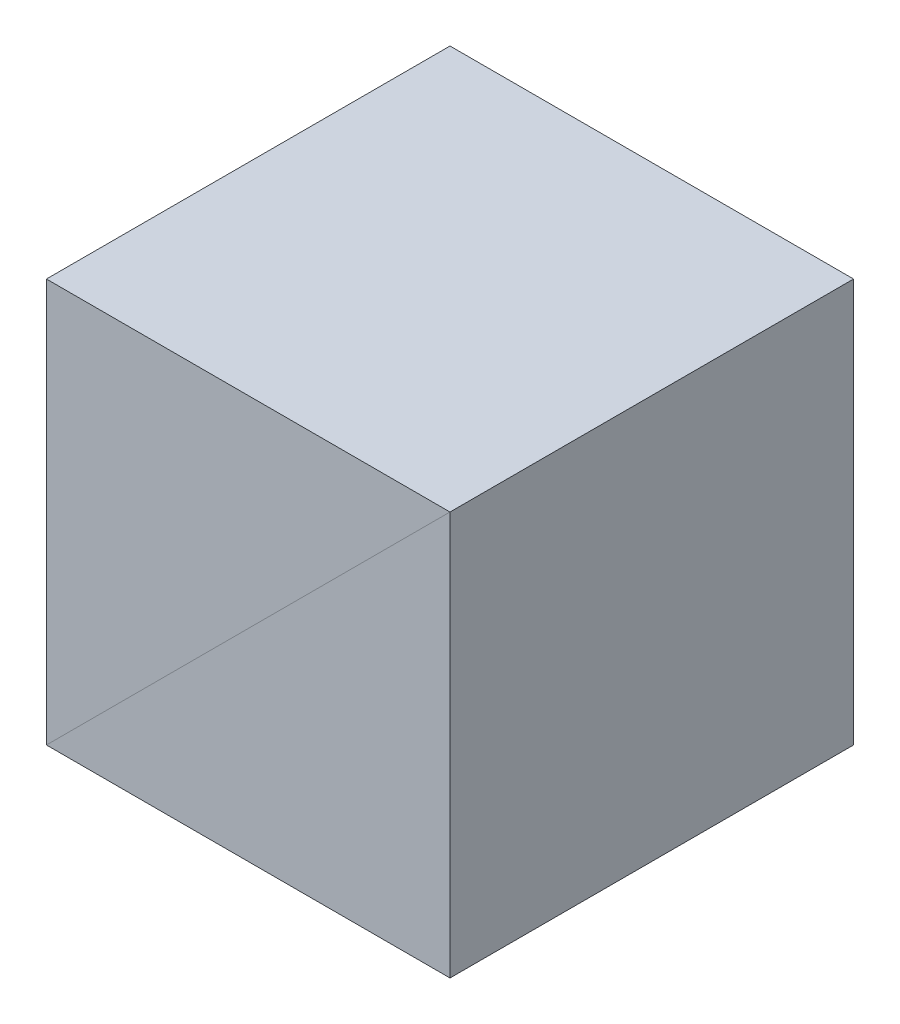
ISO-10303-21;
HEADER;
FILE_DESCRIPTION(('STEP AP214'),'2;1');
FILE_NAME('part.step','',(''),(''),'','','');
FILE_SCHEMA(('AUTOMOTIVE_DESIGN { 1 0 10303 214 1 1 1 1 }'));
ENDSEC;
DATA;
#1=APPLICATION_CONTEXT('core data for automotive mechanical design processes');
#2=APPLICATION_PROTOCOL_DEFINITION('international standard','automotive_design',2000,#1);
#3=PRODUCT_CONTEXT('',#1,'mechanical');
#4=PRODUCT('Part','Part','',(#3));
#5=PRODUCT_RELATED_PRODUCT_CATEGORY('part','',(#4));
#6=PRODUCT_DEFINITION_FORMATION('','',#4);
#7=PRODUCT_DEFINITION_CONTEXT('part definition',#1,'design');
#8=PRODUCT_DEFINITION('design','',#6,#7);
#9=PRODUCT_DEFINITION_SHAPE('','',#8);
#10=(LENGTH_UNIT() NAMED_UNIT(*) SI_UNIT(.MILLI.,.METRE.));
#11=(NAMED_UNIT(*) PLANE_ANGLE_UNIT() SI_UNIT($,.RADIAN.));
#12=(NAMED_UNIT(*) SI_UNIT($,.STERADIAN.) SOLID_ANGLE_UNIT());
#13=UNCERTAINTY_MEASURE_WITH_UNIT(LENGTH_MEASURE(1.E-05),#10,'distance_accuracy_value','');
#14=(GEOMETRIC_REPRESENTATION_CONTEXT(3) GLOBAL_UNCERTAINTY_ASSIGNED_CONTEXT((#13)) GLOBAL_UNIT_ASSIGNED_CONTEXT((#10,
#11,#12)) REPRESENTATION_CONTEXT('',''));
#15=CARTESIAN_POINT('',(0.,0.,0.));
#16=DIRECTION('',(0.,0.,1.));
#17=DIRECTION('',(1.,0.,0.));
#18=AXIS2_PLACEMENT_3D('',#15,#16,#17);
#19=CARTESIAN_POINT('',(5.,5.,5.));
#20=DIRECTION('',(-0.707106781186547,0.707106781186548,0.));
#21=DIRECTION('',(0.707106781186548,0.707106781186547,0.));
#22=AXIS2_PLACEMENT_3D('',#19,#20,#21);
#23=PLANE('',#22);
#24=DIRECTION('',(-0.707106781186548,-0.707106781186547,0.));
#25=VECTOR('',#24,1.);
#26=CARTESIAN_POINT('',(5.,5.,-5.));
#27=LINE('',#26,#25);
#28=CARTESIAN_POINT('',(5.,5.,-5.));
#29=VERTEX_POINT('',#28);
#30=CARTESIAN_POINT('',(-5.,-5.,-5.));
#31=VERTEX_POINT('',#30);
#32=EDGE_CURVE('E101',#29,#31,#27,.T.);
#33=ORIENTED_EDGE('',*,*,#32,.F.);
#34=DIRECTION('',(0.,0.,-1.));
#35=VECTOR('',#34,1.);
#36=CARTESIAN_POINT('',(5.,5.,5.));
#37=LINE('',#36,#35);
#38=CARTESIAN_POINT('',(5.,5.,5.));
#39=VERTEX_POINT('',#38);
#40=EDGE_CURVE('E96',#39,#29,#37,.T.);
#41=ORIENTED_EDGE('',*,*,#40,.F.);
#42=DIRECTION('',(-0.707106781186548,-0.707106781186547,0.));
#43=VECTOR('',#42,1.);
#44=CARTESIAN_POINT('',(5.,5.,5.));
#45=LINE('',#44,#43);
#46=CARTESIAN_POINT('',(-5.,-5.,5.));
#47=VERTEX_POINT('',#46);
#48=EDGE_CURVE('E88',#39,#47,#45,.T.);
#49=ORIENTED_EDGE('',*,*,#48,.T.);
#50=DIRECTION('',(0.,0.,-1.));
#51=VECTOR('',#50,1.);
#52=CARTESIAN_POINT('',(-5.,-5.,5.));
#53=LINE('',#52,#51);
#54=EDGE_CURVE('E12',#47,#31,#53,.T.);
#55=ORIENTED_EDGE('',*,*,#54,.T.);
#56=EDGE_LOOP('',(#33,#41,#49,#55));
#57=FACE_BOUND('',#56,.T.);
#58=ADVANCED_FACE('F49',(#57),#23,.F.);
#59=CARTESIAN_POINT('',(-5.,-5.,5.));
#60=DIRECTION('',(1.,0.,0.));
#61=DIRECTION('',(0.,0.,1.));
#62=AXIS2_PLACEMENT_3D('',#59,#60,#61);
#63=PLANE('',#62);
#64=DIRECTION('',(0.,1.,0.));
#65=VECTOR('',#64,1.);
#66=CARTESIAN_POINT('',(-5.,-5.,-5.));
#67=LINE('',#66,#65);
#68=CARTESIAN_POINT('',(-5.,5.,-5.));
#69=VERTEX_POINT('',#68);
#70=EDGE_CURVE('E93',#31,#69,#67,.T.);
#71=ORIENTED_EDGE('',*,*,#70,.F.);
#72=ORIENTED_EDGE('',*,*,#54,.F.);
#73=DIRECTION('',(0.,1.,0.));
#74=VECTOR('',#73,1.);
#75=CARTESIAN_POINT('',(-5.,-5.,5.));
#76=LINE('',#75,#74);
#77=CARTESIAN_POINT('',(-5.,5.,5.));
#78=VERTEX_POINT('',#77);
#79=EDGE_CURVE('E84',#47,#78,#76,.T.);
#80=ORIENTED_EDGE('',*,*,#79,.T.);
#81=DIRECTION('',(0.,0.,-1.));
#82=VECTOR('',#81,1.);
#83=CARTESIAN_POINT('',(-5.,5.,5.));
#84=LINE('',#83,#82);
#85=EDGE_CURVE('E57',#78,#69,#84,.T.);
#86=ORIENTED_EDGE('',*,*,#85,.T.);
#87=EDGE_LOOP('',(#71,#72,#80,#86));
#88=FACE_BOUND('',#87,.T.);
#89=ADVANCED_FACE('F92',(#88),#63,.F.);
#90=CARTESIAN_POINT('',(5.,5.,5.));
#91=DIRECTION('',(0.,-1.,0.));
#92=DIRECTION('',(-1.,0.,0.));
#93=AXIS2_PLACEMENT_3D('',#90,#91,#92);
#94=PLANE('',#93);
#95=DIRECTION('',(1.,0.,0.));
#96=VECTOR('',#95,1.);
#97=CARTESIAN_POINT('',(5.,5.,-5.));
#98=LINE('',#97,#96);
#99=EDGE_CURVE('E76',#69,#29,#98,.T.);
#100=ORIENTED_EDGE('',*,*,#99,.F.);
#101=ORIENTED_EDGE('',*,*,#85,.F.);
#102=DIRECTION('',(1.,0.,0.));
#103=VECTOR('',#102,1.);
#104=CARTESIAN_POINT('',(5.,5.,5.));
#105=LINE('',#104,#103);
#106=EDGE_CURVE('E65',#78,#39,#105,.T.);
#107=ORIENTED_EDGE('',*,*,#106,.T.);
#108=ORIENTED_EDGE('',*,*,#40,.T.);
#109=EDGE_LOOP('',(#100,#101,#107,#108));
#110=FACE_BOUND('',#109,.T.);
#111=ADVANCED_FACE('F110',(#110),#94,.F.);
#112=CARTESIAN_POINT('',(0.,0.,5.));
#113=DIRECTION('',(0.,0.,1.));
#114=DIRECTION('',(0.,1.,0.));
#115=AXIS2_PLACEMENT_3D('',#112,#113,#114);
#116=PLANE('',#115);
#117=ORIENTED_EDGE('',*,*,#48,.F.);
#118=ORIENTED_EDGE('',*,*,#106,.F.);
#119=ORIENTED_EDGE('',*,*,#79,.F.);
#120=EDGE_LOOP('',(#117,#118,#119));
#121=FACE_BOUND('',#120,.T.);
#122=ADVANCED_FACE('F86',(#121),#116,.T.);
#123=CARTESIAN_POINT('',(0.,0.,-5.));
#124=DIRECTION('',(0.,0.,1.));
#125=DIRECTION('',(0.,1.,0.));
#126=AXIS2_PLACEMENT_3D('',#123,#124,#125);
#127=PLANE('',#126);
#128=ORIENTED_EDGE('',*,*,#32,.T.);
#129=ORIENTED_EDGE('',*,*,#70,.T.);
#130=ORIENTED_EDGE('',*,*,#99,.T.);
#131=EDGE_LOOP('',(#128,#129,#130));
#132=FACE_BOUND('',#131,.T.);
#133=ADVANCED_FACE('F104',(#132),#127,.F.);
#134=CLOSED_SHELL('',(#58,#89,#111,#122,#133));
#135=MANIFOLD_SOLID_BREP('B2',#134);
#136=CARTESIAN_POINT('',(5.,5.,5.));
#137=DIRECTION('',(0.707106781186547,-0.707106781186548,0.));
#138=DIRECTION('',(0.707106781186548,0.707106781186547,0.));
#139=AXIS2_PLACEMENT_3D('',#136,#137,#138);
#140=PLANE('',#139);
#141=DIRECTION('',(-0.707106781186548,-0.707106781186547,0.));
#142=VECTOR('',#141,1.);
#143=CARTESIAN_POINT('',(5.,5.,-5.));
#144=LINE('',#143,#142);
#145=CARTESIAN_POINT('',(5.,5.,-5.));
#146=VERTEX_POINT('',#145);
#147=CARTESIAN_POINT('',(-5.,-5.,-5.));
#148=VERTEX_POINT('',#147);
#149=EDGE_CURVE('E197',#146,#148,#144,.T.);
#150=ORIENTED_EDGE('',*,*,#149,.T.);
#151=DIRECTION('',(0.,0.,-1.));
#152=VECTOR('',#151,1.);
#153=CARTESIAN_POINT('',(-5.,-5.,5.));
#154=LINE('',#153,#152);
#155=CARTESIAN_POINT('',(-5.,-5.,5.));
#156=VERTEX_POINT('',#155);
#157=EDGE_CURVE('E47',#156,#148,#154,.T.);
#158=ORIENTED_EDGE('',*,*,#157,.F.);
#159=DIRECTION('',(-0.707106781186548,-0.707106781186547,0.));
#160=VECTOR('',#159,1.);
#161=CARTESIAN_POINT('',(5.,5.,5.));
#162=LINE('',#161,#160);
#163=CARTESIAN_POINT('',(5.,5.,5.));
#164=VERTEX_POINT('',#163);
#165=EDGE_CURVE('E189',#164,#156,#162,.T.);
#166=ORIENTED_EDGE('',*,*,#165,.F.);
#167=DIRECTION('',(0.,0.,-1.));
#168=VECTOR('',#167,1.);
#169=CARTESIAN_POINT('',(5.,5.,5.));
#170=LINE('',#169,#168);
#171=EDGE_CURVE('E198',#164,#146,#170,.T.);
#172=ORIENTED_EDGE('',*,*,#171,.T.);
#173=EDGE_LOOP('',(#150,#158,#166,#172));
#174=FACE_BOUND('',#173,.T.);
#175=ADVANCED_FACE('F147',(#174),#140,.F.);
#176=CARTESIAN_POINT('',(-5.,-5.,5.));
#177=DIRECTION('',(0.,1.,0.));
#178=DIRECTION('',(0.,0.,1.));
#179=AXIS2_PLACEMENT_3D('',#176,#177,#178);
#180=PLANE('',#179);
#181=DIRECTION('',(1.,0.,0.));
#182=VECTOR('',#181,1.);
#183=CARTESIAN_POINT('',(-5.,-5.,-5.));
#184=LINE('',#183,#182);
#185=CARTESIAN_POINT('',(5.,-5.,-5.));
#186=VERTEX_POINT('',#185);
#187=EDGE_CURVE('E176',#148,#186,#184,.T.);
#188=ORIENTED_EDGE('',*,*,#187,.T.);
#189=DIRECTION('',(0.,0.,-1.));
#190=VECTOR('',#189,1.);
#191=CARTESIAN_POINT('',(5.,-5.,5.));
#192=LINE('',#191,#190);
#193=CARTESIAN_POINT('',(5.,-5.,5.));
#194=VERTEX_POINT('',#193);
#195=EDGE_CURVE('E156',#194,#186,#192,.T.);
#196=ORIENTED_EDGE('',*,*,#195,.F.);
#197=DIRECTION('',(1.,0.,0.));
#198=VECTOR('',#197,1.);
#199=CARTESIAN_POINT('',(-5.,-5.,5.));
#200=LINE('',#199,#198);
#201=EDGE_CURVE('E184',#156,#194,#200,.T.);
#202=ORIENTED_EDGE('',*,*,#201,.F.);
#203=ORIENTED_EDGE('',*,*,#157,.T.);
#204=EDGE_LOOP('',(#188,#196,#202,#203));
#205=FACE_BOUND('',#204,.T.);
#206=ADVANCED_FACE('F185',(#205),#180,.F.);
#207=CARTESIAN_POINT('',(5.,5.,5.));
#208=DIRECTION('',(-1.,0.,0.));
#209=DIRECTION('',(0.,-1.,0.));
#210=AXIS2_PLACEMENT_3D('',#207,#208,#209);
#211=PLANE('',#210);
#212=DIRECTION('',(0.,1.,0.));
#213=VECTOR('',#212,1.);
#214=CARTESIAN_POINT('',(5.,5.,-5.));
#215=LINE('',#214,#213);
#216=EDGE_CURVE('E181',#186,#146,#215,.T.);
#217=ORIENTED_EDGE('',*,*,#216,.T.);
#218=ORIENTED_EDGE('',*,*,#171,.F.);
#219=DIRECTION('',(0.,1.,0.));
#220=VECTOR('',#219,1.);
#221=CARTESIAN_POINT('',(5.,5.,5.));
#222=LINE('',#221,#220);
#223=EDGE_CURVE('E164',#194,#164,#222,.T.);
#224=ORIENTED_EDGE('',*,*,#223,.F.);
#225=ORIENTED_EDGE('',*,*,#195,.T.);
#226=EDGE_LOOP('',(#217,#218,#224,#225));
#227=FACE_BOUND('',#226,.T.);
#228=ADVANCED_FACE('F210',(#227),#211,.F.);
#229=CARTESIAN_POINT('',(0.,0.,5.));
#230=DIRECTION('',(0.,0.,1.));
#231=DIRECTION('',(1.,0.,0.));
#232=AXIS2_PLACEMENT_3D('',#229,#230,#231);
#233=PLANE('',#232);
#234=ORIENTED_EDGE('',*,*,#165,.T.);
#235=ORIENTED_EDGE('',*,*,#201,.T.);
#236=ORIENTED_EDGE('',*,*,#223,.T.);
#237=EDGE_LOOP('',(#234,#235,#236));
#238=FACE_BOUND('',#237,.T.);
#239=ADVANCED_FACE('F192',(#238),#233,.T.);
#240=CARTESIAN_POINT('',(0.,0.,-5.));
#241=DIRECTION('',(0.,0.,1.));
#242=DIRECTION('',(1.,0.,0.));
#243=AXIS2_PLACEMENT_3D('',#240,#241,#242);
#244=PLANE('',#243);
#245=ORIENTED_EDGE('',*,*,#149,.F.);
#246=ORIENTED_EDGE('',*,*,#216,.F.);
#247=ORIENTED_EDGE('',*,*,#187,.F.);
#248=EDGE_LOOP('',(#245,#246,#247));
#249=FACE_BOUND('',#248,.T.);
#250=ADVANCED_FACE('F211',(#249),#244,.F.);
#251=CLOSED_SHELL('',(#175,#206,#228,#239,#250));
#252=MANIFOLD_SOLID_BREP('B6',#251);
#253=ADVANCED_BREP_SHAPE_REPRESENTATION('',(#18,#135,#252),#14);
#254=SHAPE_DEFINITION_REPRESENTATION(#9,#253);
ENDSEC;
END-ISO-10303-21;
